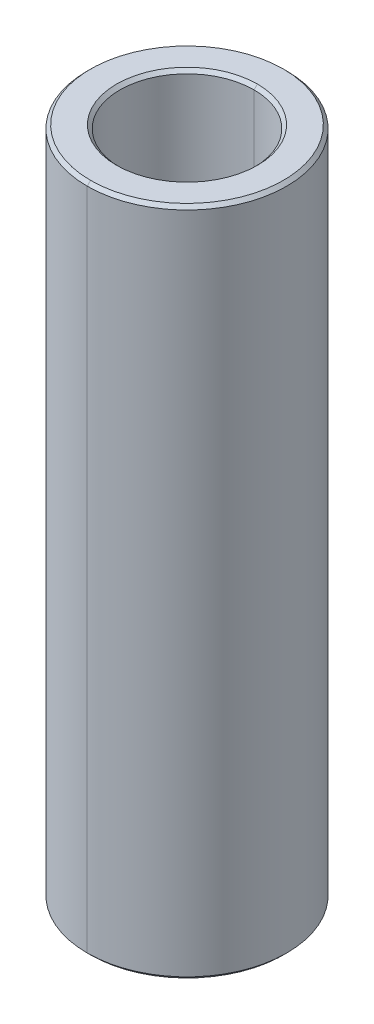
ISO-10303-21;
HEADER;
FILE_DESCRIPTION(('STEP AP214'),'2;1');
FILE_NAME('part.step','',(''),(''),'','','');
FILE_SCHEMA(('AUTOMOTIVE_DESIGN { 1 0 10303 214 1 1 1 1 }'));
ENDSEC;
DATA;
#1=APPLICATION_CONTEXT('core data for automotive mechanical design processes');
#2=APPLICATION_PROTOCOL_DEFINITION('international standard','automotive_design',2000,#1);
#3=PRODUCT_CONTEXT('',#1,'mechanical');
#4=PRODUCT('Part','Part','',(#3));
#5=PRODUCT_RELATED_PRODUCT_CATEGORY('part','',(#4));
#6=PRODUCT_DEFINITION_FORMATION('','',#4);
#7=PRODUCT_DEFINITION_CONTEXT('part definition',#1,'design');
#8=PRODUCT_DEFINITION('design','',#6,#7);
#9=PRODUCT_DEFINITION_SHAPE('','',#8);
#10=(LENGTH_UNIT() NAMED_UNIT(*) SI_UNIT(.MILLI.,.METRE.));
#11=(NAMED_UNIT(*) PLANE_ANGLE_UNIT() SI_UNIT($,.RADIAN.));
#12=(NAMED_UNIT(*) SI_UNIT($,.STERADIAN.) SOLID_ANGLE_UNIT());
#13=UNCERTAINTY_MEASURE_WITH_UNIT(LENGTH_MEASURE(1.E-05),#10,'distance_accuracy_value','');
#14=(GEOMETRIC_REPRESENTATION_CONTEXT(3) GLOBAL_UNCERTAINTY_ASSIGNED_CONTEXT((#13)) GLOBAL_UNIT_ASSIGNED_CONTEXT((#10,
#11,#12)) REPRESENTATION_CONTEXT('',''));
#15=CARTESIAN_POINT('',(0.,0.,0.));
#16=DIRECTION('',(0.,0.,1.));
#17=DIRECTION('',(1.,0.,0.));
#18=AXIS2_PLACEMENT_3D('',#15,#16,#17);
#19=CARTESIAN_POINT('',(0.,9.9,0.));
#20=DIRECTION('',(0.,1.,0.));
#21=DIRECTION('',(0.,0.,1.));
#22=AXIS2_PLACEMENT_3D('',#19,#20,#21);
#23=CONICAL_SURFACE('',#22,2.,0.785398163397448);
#24=DIRECTION('',(0.,0.707106781186548,-0.707106781186548));
#25=VECTOR('',#24,1.);
#26=CARTESIAN_POINT('',(0.,9.9,-2.));
#27=LINE('',#26,#25);
#28=CARTESIAN_POINT('',(0.,9.9,-2.));
#29=VERTEX_POINT('',#28);
#30=CARTESIAN_POINT('',(0.,10.,-2.1));
#31=VERTEX_POINT('',#30);
#32=EDGE_CURVE('E154',#29,#31,#27,.T.);
#33=ORIENTED_EDGE('',*,*,#32,.F.);
#34=CARTESIAN_POINT('',(0.,9.9,0.));
#35=DIRECTION('',(0.,1.,0.));
#36=DIRECTION('',(0.,0.,1.));
#37=AXIS2_PLACEMENT_3D('',#34,#35,#36);
#38=CIRCLE('',#37,2.);
#39=CARTESIAN_POINT('',(0.,9.9,2.));
#40=VERTEX_POINT('',#39);
#41=EDGE_CURVE('E25',#40,#29,#38,.T.);
#42=ORIENTED_EDGE('',*,*,#41,.F.);
#43=DIRECTION('',(0.,0.707106781186548,0.707106781186548));
#44=VECTOR('',#43,1.);
#45=CARTESIAN_POINT('',(0.,9.9,2.));
#46=LINE('',#45,#44);
#47=CARTESIAN_POINT('',(0.,10.,2.1));
#48=VERTEX_POINT('',#47);
#49=EDGE_CURVE('E133',#40,#48,#46,.T.);
#50=ORIENTED_EDGE('',*,*,#49,.T.);
#51=CARTESIAN_POINT('',(0.,10.,0.));
#52=DIRECTION('',(0.,-1.,0.));
#53=DIRECTION('',(0.,0.,1.));
#54=AXIS2_PLACEMENT_3D('',#51,#52,#53);
#55=CIRCLE('',#54,2.1);
#56=EDGE_CURVE('E68',#31,#48,#55,.T.);
#57=ORIENTED_EDGE('',*,*,#56,.F.);
#58=EDGE_LOOP('',(#33,#42,#50,#57));
#59=FACE_BOUND('',#58,.T.);
#60=ADVANCED_FACE('F14',(#59),#23,.F.);
#61=CARTESIAN_POINT('',(0.,-10.,0.));
#62=DIRECTION('',(0.,-1.,0.));
#63=DIRECTION('',(0.,0.,-1.));
#64=AXIS2_PLACEMENT_3D('',#61,#62,#63);
#65=CONICAL_SURFACE('',#64,2.1,0.785398163397448);
#66=DIRECTION('',(0.,-0.707106781186548,0.707106781186548));
#67=VECTOR('',#66,1.);
#68=CARTESIAN_POINT('',(0.,-10.,2.1));
#69=LINE('',#68,#67);
#70=CARTESIAN_POINT('',(0.,-9.9,2.));
#71=VERTEX_POINT('',#70);
#72=CARTESIAN_POINT('',(0.,-10.,2.1));
#73=VERTEX_POINT('',#72);
#74=EDGE_CURVE('E108',#71,#73,#69,.T.);
#75=ORIENTED_EDGE('',*,*,#74,.F.);
#76=CARTESIAN_POINT('',(0.,-9.9,0.));
#77=DIRECTION('',(0.,-1.,0.));
#78=DIRECTION('',(0.,0.,1.));
#79=AXIS2_PLACEMENT_3D('',#76,#77,#78);
#80=CIRCLE('',#79,2.);
#81=CARTESIAN_POINT('',(0.,-9.9,-2.));
#82=VERTEX_POINT('',#81);
#83=EDGE_CURVE('E9',#82,#71,#80,.T.);
#84=ORIENTED_EDGE('',*,*,#83,.F.);
#85=DIRECTION('',(0.,-0.707106781186548,-0.707106781186548));
#86=VECTOR('',#85,1.);
#87=CARTESIAN_POINT('',(0.,-10.,-2.1));
#88=LINE('',#87,#86);
#89=CARTESIAN_POINT('',(0.,-10.,-2.1));
#90=VERTEX_POINT('',#89);
#91=EDGE_CURVE('E111',#82,#90,#88,.T.);
#92=ORIENTED_EDGE('',*,*,#91,.T.);
#93=CARTESIAN_POINT('',(0.,-10.,0.));
#94=DIRECTION('',(0.,1.,0.));
#95=DIRECTION('',(0.,0.,1.));
#96=AXIS2_PLACEMENT_3D('',#93,#94,#95);
#97=CIRCLE('',#96,2.1);
#98=EDGE_CURVE('E104',#73,#90,#97,.T.);
#99=ORIENTED_EDGE('',*,*,#98,.F.);
#100=EDGE_LOOP('',(#75,#84,#92,#99));
#101=FACE_BOUND('',#100,.T.);
#102=ADVANCED_FACE('F106',(#101),#65,.F.);
#103=CARTESIAN_POINT('',(0.,10.,0.));
#104=DIRECTION('',(0.,-1.,0.));
#105=DIRECTION('',(0.,0.,-1.));
#106=AXIS2_PLACEMENT_3D('',#103,#104,#105);
#107=CONICAL_SURFACE('',#106,2.875,0.78539816339744);
#108=DIRECTION('',(0.,-0.707106781186554,0.707106781186542));
#109=VECTOR('',#108,1.);
#110=CARTESIAN_POINT('',(0.,10.,2.875));
#111=LINE('',#110,#109);
#112=CARTESIAN_POINT('',(0.,10.,2.875));
#113=VERTEX_POINT('',#112);
#114=CARTESIAN_POINT('',(0.,9.9,2.975));
#115=VERTEX_POINT('',#114);
#116=EDGE_CURVE('E205',#113,#115,#111,.T.);
#117=ORIENTED_EDGE('',*,*,#116,.F.);
#118=CARTESIAN_POINT('',(0.,10.,0.));
#119=DIRECTION('',(0.,1.,0.));
#120=DIRECTION('',(0.,0.,1.));
#121=AXIS2_PLACEMENT_3D('',#118,#119,#120);
#122=CIRCLE('',#121,2.875);
#123=CARTESIAN_POINT('',(0.,10.,-2.875));
#124=VERTEX_POINT('',#123);
#125=EDGE_CURVE('E18',#124,#113,#122,.T.);
#126=ORIENTED_EDGE('',*,*,#125,.F.);
#127=DIRECTION('',(0.,-0.707106781186554,-0.707106781186542));
#128=VECTOR('',#127,1.);
#129=CARTESIAN_POINT('',(0.,10.,-2.875));
#130=LINE('',#129,#128);
#131=CARTESIAN_POINT('',(0.,9.9,-2.975));
#132=VERTEX_POINT('',#131);
#133=EDGE_CURVE('E156',#124,#132,#130,.T.);
#134=ORIENTED_EDGE('',*,*,#133,.T.);
#135=CARTESIAN_POINT('',(0.,9.9,0.));
#136=DIRECTION('',(0.,-1.,0.));
#137=DIRECTION('',(0.,0.,1.));
#138=AXIS2_PLACEMENT_3D('',#135,#136,#137);
#139=CIRCLE('',#138,2.975);
#140=EDGE_CURVE('E115',#115,#132,#139,.T.);
#141=ORIENTED_EDGE('',*,*,#140,.F.);
#142=EDGE_LOOP('',(#117,#126,#134,#141));
#143=FACE_BOUND('',#142,.T.);
#144=ADVANCED_FACE('F206',(#143),#107,.T.);
#145=CARTESIAN_POINT('',(0.,-9.9,0.));
#146=DIRECTION('',(0.,1.,0.));
#147=DIRECTION('',(0.,0.,1.));
#148=AXIS2_PLACEMENT_3D('',#145,#146,#147);
#149=CONICAL_SURFACE('',#148,2.975,0.78539816339744);
#150=DIRECTION('',(0.,0.707106781186554,-0.707106781186542));
#151=VECTOR('',#150,1.);
#152=CARTESIAN_POINT('',(0.,-9.9,-2.975));
#153=LINE('',#152,#151);
#154=CARTESIAN_POINT('',(0.,-10.,-2.875));
#155=VERTEX_POINT('',#154);
#156=CARTESIAN_POINT('',(0.,-9.9,-2.975));
#157=VERTEX_POINT('',#156);
#158=EDGE_CURVE('E178',#155,#157,#153,.T.);
#159=ORIENTED_EDGE('',*,*,#158,.F.);
#160=CARTESIAN_POINT('',(0.,-10.,0.));
#161=DIRECTION('',(0.,-1.,0.));
#162=DIRECTION('',(0.,0.,1.));
#163=AXIS2_PLACEMENT_3D('',#160,#161,#162);
#164=CIRCLE('',#163,2.875);
#165=CARTESIAN_POINT('',(0.,-10.,2.875));
#166=VERTEX_POINT('',#165);
#167=EDGE_CURVE('E116',#166,#155,#164,.T.);
#168=ORIENTED_EDGE('',*,*,#167,.F.);
#169=DIRECTION('',(0.,0.707106781186554,0.707106781186542));
#170=VECTOR('',#169,1.);
#171=CARTESIAN_POINT('',(0.,-9.9,2.975));
#172=LINE('',#171,#170);
#173=CARTESIAN_POINT('',(0.,-9.9,2.975));
#174=VERTEX_POINT('',#173);
#175=EDGE_CURVE('E146',#166,#174,#172,.T.);
#176=ORIENTED_EDGE('',*,*,#175,.T.);
#177=CARTESIAN_POINT('',(0.,-9.9,0.));
#178=DIRECTION('',(0.,1.,0.));
#179=DIRECTION('',(0.,0.,1.));
#180=AXIS2_PLACEMENT_3D('',#177,#178,#179);
#181=CIRCLE('',#180,2.975);
#182=EDGE_CURVE('E40',#157,#174,#181,.T.);
#183=ORIENTED_EDGE('',*,*,#182,.F.);
#184=EDGE_LOOP('',(#159,#168,#176,#183));
#185=FACE_BOUND('',#184,.T.);
#186=ADVANCED_FACE('F241',(#185),#149,.T.);
#187=CARTESIAN_POINT('',(0.,10.,0.));
#188=DIRECTION('',(0.,-1.,0.));
#189=DIRECTION('',(0.,0.,-1.));
#190=AXIS2_PLACEMENT_3D('',#187,#188,#189);
#191=CYLINDRICAL_SURFACE('',#190,2.);
#192=DIRECTION('',(0.,-1.,0.));
#193=VECTOR('',#192,1.);
#194=CARTESIAN_POINT('',(0.,10.,2.));
#195=LINE('',#194,#193);
#196=EDGE_CURVE('E143',#40,#71,#195,.T.);
#197=ORIENTED_EDGE('',*,*,#196,.F.);
#198=ORIENTED_EDGE('',*,*,#41,.T.);
#199=DIRECTION('',(0.,-1.,0.));
#200=VECTOR('',#199,1.);
#201=CARTESIAN_POINT('',(0.,10.,-2.));
#202=LINE('',#201,#200);
#203=EDGE_CURVE('E139',#29,#82,#202,.T.);
#204=ORIENTED_EDGE('',*,*,#203,.T.);
#205=ORIENTED_EDGE('',*,*,#83,.T.);
#206=EDGE_LOOP('',(#197,#198,#204,#205));
#207=FACE_BOUND('',#206,.T.);
#208=ADVANCED_FACE('F238',(#207),#191,.F.);
#209=CARTESIAN_POINT('',(0.,10.,0.));
#210=DIRECTION('',(0.,-1.,0.));
#211=DIRECTION('',(0.,0.,-1.));
#212=AXIS2_PLACEMENT_3D('',#209,#210,#211);
#213=CYLINDRICAL_SURFACE('',#212,2.975);
#214=DIRECTION('',(0.,-1.,0.));
#215=VECTOR('',#214,1.);
#216=CARTESIAN_POINT('',(0.,10.,2.975));
#217=LINE('',#216,#215);
#218=EDGE_CURVE('E142',#115,#174,#217,.T.);
#219=ORIENTED_EDGE('',*,*,#218,.F.);
#220=ORIENTED_EDGE('',*,*,#140,.T.);
#221=DIRECTION('',(0.,-1.,0.));
#222=VECTOR('',#221,1.);
#223=CARTESIAN_POINT('',(0.,10.,-2.975));
#224=LINE('',#223,#222);
#225=EDGE_CURVE('E161',#132,#157,#224,.T.);
#226=ORIENTED_EDGE('',*,*,#225,.T.);
#227=ORIENTED_EDGE('',*,*,#182,.T.);
#228=EDGE_LOOP('',(#219,#220,#226,#227));
#229=FACE_BOUND('',#228,.T.);
#230=ADVANCED_FACE('F240',(#229),#213,.T.);
#231=CARTESIAN_POINT('',(0.,-10.,0.));
#232=DIRECTION('',(0.,1.,0.));
#233=DIRECTION('',(1.,0.,0.));
#234=AXIS2_PLACEMENT_3D('',#231,#232,#233);
#235=PLANE('',#234);
#236=CARTESIAN_POINT('',(0.,-10.,0.));
#237=DIRECTION('',(0.,1.,0.));
#238=DIRECTION('',(0.,0.,1.));
#239=AXIS2_PLACEMENT_3D('',#236,#237,#238);
#240=CIRCLE('',#239,2.1);
#241=EDGE_CURVE('E118',#90,#73,#240,.T.);
#242=ORIENTED_EDGE('',*,*,#241,.T.);
#243=ORIENTED_EDGE('',*,*,#98,.T.);
#244=EDGE_LOOP('',(#242,#243));
#245=FACE_BOUND('',#244,.T.);
#246=ORIENTED_EDGE('',*,*,#167,.T.);
#247=CARTESIAN_POINT('',(0.,-10.,0.));
#248=DIRECTION('',(0.,-1.,0.));
#249=DIRECTION('',(0.,0.,1.));
#250=AXIS2_PLACEMENT_3D('',#247,#248,#249);
#251=CIRCLE('',#250,2.875);
#252=EDGE_CURVE('E137',#155,#166,#251,.T.);
#253=ORIENTED_EDGE('',*,*,#252,.T.);
#254=EDGE_LOOP('',(#246,#253));
#255=FACE_BOUND('',#254,.T.);
#256=ADVANCED_FACE('F16',(#245,#255),#235,.F.);
#257=CARTESIAN_POINT('',(0.,10.,0.));
#258=DIRECTION('',(0.,1.,0.));
#259=DIRECTION('',(1.,0.,0.));
#260=AXIS2_PLACEMENT_3D('',#257,#258,#259);
#261=PLANE('',#260);
#262=CARTESIAN_POINT('',(0.,10.,0.));
#263=DIRECTION('',(0.,-1.,0.));
#264=DIRECTION('',(0.,0.,1.));
#265=AXIS2_PLACEMENT_3D('',#262,#263,#264);
#266=CIRCLE('',#265,2.1);
#267=EDGE_CURVE('E152',#48,#31,#266,.T.);
#268=ORIENTED_EDGE('',*,*,#267,.T.);
#269=ORIENTED_EDGE('',*,*,#56,.T.);
#270=EDGE_LOOP('',(#268,#269));
#271=FACE_BOUND('',#270,.T.);
#272=ORIENTED_EDGE('',*,*,#125,.T.);
#273=CARTESIAN_POINT('',(0.,10.,0.));
#274=DIRECTION('',(0.,1.,0.));
#275=DIRECTION('',(0.,0.,1.));
#276=AXIS2_PLACEMENT_3D('',#273,#274,#275);
#277=CIRCLE('',#276,2.875);
#278=EDGE_CURVE('E201',#113,#124,#277,.T.);
#279=ORIENTED_EDGE('',*,*,#278,.T.);
#280=EDGE_LOOP('',(#272,#279));
#281=FACE_BOUND('',#280,.T.);
#282=ADVANCED_FACE('F193',(#271,#281),#261,.T.);
#283=CARTESIAN_POINT('',(0.,10.,0.));
#284=DIRECTION('',(0.,-1.,0.));
#285=DIRECTION('',(0.,0.,-1.));
#286=AXIS2_PLACEMENT_3D('',#283,#284,#285);
#287=CYLINDRICAL_SURFACE('',#286,2.975);
#288=CARTESIAN_POINT('',(0.,9.9,0.));
#289=DIRECTION('',(0.,-1.,0.));
#290=DIRECTION('',(0.,0.,1.));
#291=AXIS2_PLACEMENT_3D('',#288,#289,#290);
#292=CIRCLE('',#291,2.975);
#293=EDGE_CURVE('E160',#132,#115,#292,.T.);
#294=ORIENTED_EDGE('',*,*,#293,.T.);
#295=ORIENTED_EDGE('',*,*,#218,.T.);
#296=CARTESIAN_POINT('',(0.,-9.9,0.));
#297=DIRECTION('',(0.,1.,0.));
#298=DIRECTION('',(0.,0.,1.));
#299=AXIS2_PLACEMENT_3D('',#296,#297,#298);
#300=CIRCLE('',#299,2.975);
#301=EDGE_CURVE('E150',#174,#157,#300,.T.);
#302=ORIENTED_EDGE('',*,*,#301,.T.);
#303=ORIENTED_EDGE('',*,*,#225,.F.);
#304=EDGE_LOOP('',(#294,#295,#302,#303));
#305=FACE_BOUND('',#304,.T.);
#306=ADVANCED_FACE('F196',(#305),#287,.T.);
#307=CARTESIAN_POINT('',(0.,10.,0.));
#308=DIRECTION('',(0.,-1.,0.));
#309=DIRECTION('',(0.,0.,-1.));
#310=AXIS2_PLACEMENT_3D('',#307,#308,#309);
#311=CYLINDRICAL_SURFACE('',#310,2.);
#312=CARTESIAN_POINT('',(0.,9.9,0.));
#313=DIRECTION('',(0.,1.,0.));
#314=DIRECTION('',(0.,0.,1.));
#315=AXIS2_PLACEMENT_3D('',#312,#313,#314);
#316=CIRCLE('',#315,2.);
#317=EDGE_CURVE('E220',#29,#40,#316,.T.);
#318=ORIENTED_EDGE('',*,*,#317,.T.);
#319=ORIENTED_EDGE('',*,*,#196,.T.);
#320=CARTESIAN_POINT('',(0.,-9.9,0.));
#321=DIRECTION('',(0.,-1.,0.));
#322=DIRECTION('',(0.,0.,1.));
#323=AXIS2_PLACEMENT_3D('',#320,#321,#322);
#324=CIRCLE('',#323,2.);
#325=EDGE_CURVE('E125',#71,#82,#324,.T.);
#326=ORIENTED_EDGE('',*,*,#325,.T.);
#327=ORIENTED_EDGE('',*,*,#203,.F.);
#328=EDGE_LOOP('',(#318,#319,#326,#327));
#329=FACE_BOUND('',#328,.T.);
#330=ADVANCED_FACE('F234',(#329),#311,.F.);
#331=CARTESIAN_POINT('',(0.,-9.9,0.));
#332=DIRECTION('',(0.,1.,0.));
#333=DIRECTION('',(0.,0.,1.));
#334=AXIS2_PLACEMENT_3D('',#331,#332,#333);
#335=CONICAL_SURFACE('',#334,2.975,0.78539816339744);
#336=ORIENTED_EDGE('',*,*,#252,.F.);
#337=ORIENTED_EDGE('',*,*,#158,.T.);
#338=ORIENTED_EDGE('',*,*,#301,.F.);
#339=ORIENTED_EDGE('',*,*,#175,.F.);
#340=EDGE_LOOP('',(#336,#337,#338,#339));
#341=FACE_BOUND('',#340,.T.);
#342=ADVANCED_FACE('F259',(#341),#335,.T.);
#343=CARTESIAN_POINT('',(0.,10.,0.));
#344=DIRECTION('',(0.,-1.,0.));
#345=DIRECTION('',(0.,0.,-1.));
#346=AXIS2_PLACEMENT_3D('',#343,#344,#345);
#347=CONICAL_SURFACE('',#346,2.875,0.78539816339744);
#348=ORIENTED_EDGE('',*,*,#278,.F.);
#349=ORIENTED_EDGE('',*,*,#116,.T.);
#350=ORIENTED_EDGE('',*,*,#293,.F.);
#351=ORIENTED_EDGE('',*,*,#133,.F.);
#352=EDGE_LOOP('',(#348,#349,#350,#351));
#353=FACE_BOUND('',#352,.T.);
#354=ADVANCED_FACE('F211',(#353),#347,.T.);
#355=CARTESIAN_POINT('',(0.,-10.,0.));
#356=DIRECTION('',(0.,-1.,0.));
#357=DIRECTION('',(0.,0.,-1.));
#358=AXIS2_PLACEMENT_3D('',#355,#356,#357);
#359=CONICAL_SURFACE('',#358,2.1,0.785398163397448);
#360=ORIENTED_EDGE('',*,*,#325,.F.);
#361=ORIENTED_EDGE('',*,*,#74,.T.);
#362=ORIENTED_EDGE('',*,*,#241,.F.);
#363=ORIENTED_EDGE('',*,*,#91,.F.);
#364=EDGE_LOOP('',(#360,#361,#362,#363));
#365=FACE_BOUND('',#364,.T.);
#366=ADVANCED_FACE('F123',(#365),#359,.F.);
#367=CARTESIAN_POINT('',(0.,9.9,0.));
#368=DIRECTION('',(0.,1.,0.));
#369=DIRECTION('',(0.,0.,1.));
#370=AXIS2_PLACEMENT_3D('',#367,#368,#369);
#371=CONICAL_SURFACE('',#370,2.,0.785398163397448);
#372=ORIENTED_EDGE('',*,*,#317,.F.);
#373=ORIENTED_EDGE('',*,*,#32,.T.);
#374=ORIENTED_EDGE('',*,*,#267,.F.);
#375=ORIENTED_EDGE('',*,*,#49,.F.);
#376=EDGE_LOOP('',(#372,#373,#374,#375));
#377=FACE_BOUND('',#376,.T.);
#378=ADVANCED_FACE('F192',(#377),#371,.F.);
#379=CLOSED_SHELL('',(#60,#102,#144,#186,#208,#230,#256,#282,#306,#330,#342,#354,#366,#378));
#380=MANIFOLD_SOLID_BREP('B1',#379);
#381=ADVANCED_BREP_SHAPE_REPRESENTATION('',(#18,#380),#14);
#382=SHAPE_DEFINITION_REPRESENTATION(#9,#381);
ENDSEC;
END-ISO-10303-21;
